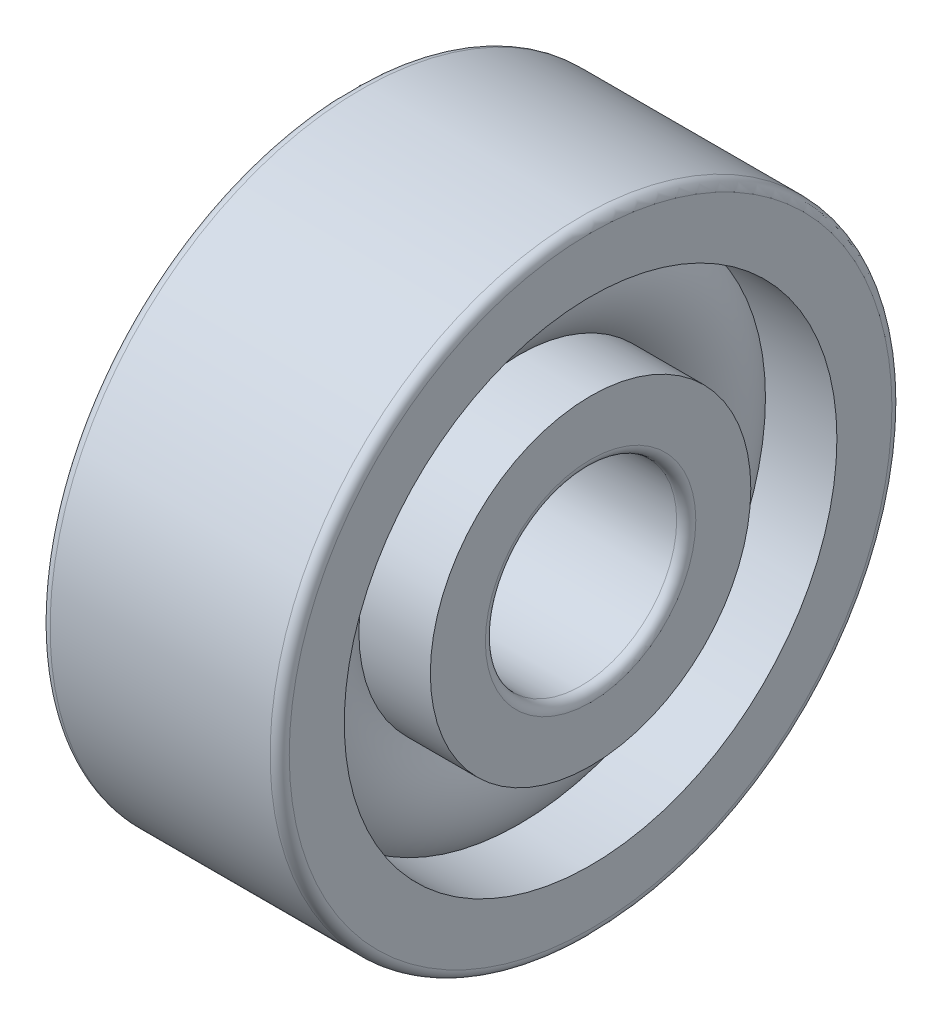
ISO-10303-21;
HEADER;
FILE_DESCRIPTION(('STEP AP214'),'2;1');
FILE_NAME('part.step','',(''),(''),'','','');
FILE_SCHEMA(('AUTOMOTIVE_DESIGN { 1 0 10303 214 1 1 1 1 }'));
ENDSEC;
DATA;
#1=APPLICATION_CONTEXT('core data for automotive mechanical design processes');
#2=APPLICATION_PROTOCOL_DEFINITION('international standard','automotive_design',2000,#1);
#3=PRODUCT_CONTEXT('',#1,'mechanical');
#4=PRODUCT('Part','Part','',(#3));
#5=PRODUCT_RELATED_PRODUCT_CATEGORY('part','',(#4));
#6=PRODUCT_DEFINITION_FORMATION('','',#4);
#7=PRODUCT_DEFINITION_CONTEXT('part definition',#1,'design');
#8=PRODUCT_DEFINITION('design','',#6,#7);
#9=PRODUCT_DEFINITION_SHAPE('','',#8);
#10=(LENGTH_UNIT() NAMED_UNIT(*) SI_UNIT(.MILLI.,.METRE.));
#11=(NAMED_UNIT(*) PLANE_ANGLE_UNIT() SI_UNIT($,.RADIAN.));
#12=(NAMED_UNIT(*) SI_UNIT($,.STERADIAN.) SOLID_ANGLE_UNIT());
#13=UNCERTAINTY_MEASURE_WITH_UNIT(LENGTH_MEASURE(1.E-05),#10,'distance_accuracy_value','');
#14=(GEOMETRIC_REPRESENTATION_CONTEXT(3) GLOBAL_UNCERTAINTY_ASSIGNED_CONTEXT((#13)) GLOBAL_UNIT_ASSIGNED_CONTEXT((#10,
#11,#12)) REPRESENTATION_CONTEXT('',''));
#15=CARTESIAN_POINT('',(0.,0.,0.));
#16=DIRECTION('',(0.,0.,1.));
#17=DIRECTION('',(1.,0.,0.));
#18=AXIS2_PLACEMENT_3D('',#15,#16,#17);
#19=CARTESIAN_POINT('',(0.,0.,0.));
#20=DIRECTION('',(-1.,0.,0.));
#21=DIRECTION('',(0.,0.,1.));
#22=AXIS2_PLACEMENT_3D('',#19,#20,#21);
#23=TOROIDAL_SURFACE('',#22,4.25,1.35);
#24=CARTESIAN_POINT('',(1.0062305898749,0.,0.));
#25=DIRECTION('',(-1.,0.,0.));
#26=DIRECTION('',(0.,0.,1.));
#27=AXIS2_PLACEMENT_3D('',#24,#25,#26);
#28=CIRCLE('',#27,5.15000000000001);
#29=CARTESIAN_POINT('',(1.0062305898749,0.,5.15000000000001));
#30=VERTEX_POINT('',#29);
#31=EDGE_CURVE('E34',#30,#30,#28,.F.);
#32=ORIENTED_EDGE('',*,*,#31,.T.);
#33=EDGE_LOOP('',(#32));
#34=FACE_BOUND('',#33,.T.);
#35=CARTESIAN_POINT('',(1.0062305898749,0.,0.));
#36=DIRECTION('',(-1.,0.,0.));
#37=DIRECTION('',(0.,0.,1.));
#38=AXIS2_PLACEMENT_3D('',#35,#36,#37);
#39=CIRCLE('',#38,3.35);
#40=CARTESIAN_POINT('',(1.0062305898749,0.,3.35));
#41=VERTEX_POINT('',#40);
#42=EDGE_CURVE('E10',#41,#41,#39,.T.);
#43=ORIENTED_EDGE('',*,*,#42,.T.);
#44=EDGE_LOOP('',(#43));
#45=FACE_BOUND('',#44,.T.);
#46=ADVANCED_FACE('F30',(#34,#45),#23,.T.);
#47=CARTESIAN_POINT('',(-20.6375,0.,0.));
#48=DIRECTION('',(1.,0.,0.));
#49=DIRECTION('',(0.,0.,-1.));
#50=AXIS2_PLACEMENT_3D('',#47,#48,#49);
#51=CYLINDRICAL_SURFACE('',#50,3.35);
#52=CARTESIAN_POINT('',(2.5,0.,0.));
#53=DIRECTION('',(1.,0.,0.));
#54=DIRECTION('',(0.,0.,-1.));
#55=AXIS2_PLACEMENT_3D('',#52,#53,#54);
#56=CIRCLE('',#55,3.35);
#57=CARTESIAN_POINT('',(2.5,0.,-3.35));
#58=VERTEX_POINT('',#57);
#59=EDGE_CURVE('E43',#58,#58,#56,.T.);
#60=ORIENTED_EDGE('',*,*,#59,.F.);
#61=EDGE_LOOP('',(#60));
#62=FACE_BOUND('',#61,.T.);
#63=ORIENTED_EDGE('',*,*,#42,.F.);
#64=EDGE_LOOP('',(#63));
#65=FACE_BOUND('',#64,.T.);
#66=ADVANCED_FACE('F82',(#62,#65),#51,.T.);
#67=CARTESIAN_POINT('',(-20.6375,0.,0.));
#68=DIRECTION('',(1.,0.,0.));
#69=DIRECTION('',(0.,0.,-1.));
#70=AXIS2_PLACEMENT_3D('',#67,#68,#69);
#71=CYLINDRICAL_SURFACE('',#70,3.35);
#72=CARTESIAN_POINT('',(-2.5,0.,0.));
#73=DIRECTION('',(1.,0.,0.));
#74=DIRECTION('',(0.,0.,-1.));
#75=AXIS2_PLACEMENT_3D('',#72,#73,#74);
#76=CIRCLE('',#75,3.35);
#77=CARTESIAN_POINT('',(-2.5,0.,-3.35));
#78=VERTEX_POINT('',#77);
#79=EDGE_CURVE('E52',#78,#78,#76,.T.);
#80=ORIENTED_EDGE('',*,*,#79,.T.);
#81=EDGE_LOOP('',(#80));
#82=FACE_BOUND('',#81,.T.);
#83=CARTESIAN_POINT('',(-1.0062305898749,0.,0.));
#84=DIRECTION('',(1.,0.,0.));
#85=DIRECTION('',(0.,0.,-1.));
#86=AXIS2_PLACEMENT_3D('',#83,#84,#85);
#87=CIRCLE('',#86,3.35);
#88=CARTESIAN_POINT('',(-1.0062305898749,0.,-3.35));
#89=VERTEX_POINT('',#88);
#90=EDGE_CURVE('E38',#89,#89,#87,.T.);
#91=ORIENTED_EDGE('',*,*,#90,.F.);
#92=EDGE_LOOP('',(#91));
#93=FACE_BOUND('',#92,.T.);
#94=ADVANCED_FACE('F85',(#82,#93),#71,.T.);
#95=CARTESIAN_POINT('',(2.5,2.2,0.));
#96=DIRECTION('',(1.,0.,0.));
#97=DIRECTION('',(0.,0.,-1.));
#98=AXIS2_PLACEMENT_3D('',#95,#96,#97);
#99=PLANE('',#98);
#100=ORIENTED_EDGE('',*,*,#59,.T.);
#101=EDGE_LOOP('',(#100));
#102=FACE_BOUND('',#101,.T.);
#103=CARTESIAN_POINT('',(2.5,0.,0.));
#104=DIRECTION('',(1.,0.,0.));
#105=DIRECTION('',(0.,0.,-1.));
#106=AXIS2_PLACEMENT_3D('',#103,#104,#105);
#107=CIRCLE('',#106,2.2);
#108=CARTESIAN_POINT('',(2.5,0.,-2.2));
#109=VERTEX_POINT('',#108);
#110=EDGE_CURVE('E74',#109,#109,#107,.T.);
#111=ORIENTED_EDGE('',*,*,#110,.F.);
#112=EDGE_LOOP('',(#111));
#113=FACE_BOUND('',#112,.T.);
#114=ADVANCED_FACE('F79',(#102,#113),#99,.T.);
#115=CARTESIAN_POINT('',(2.3,0.,0.));
#116=DIRECTION('',(1.,0.,0.));
#117=DIRECTION('',(0.,0.,-1.));
#118=AXIS2_PLACEMENT_3D('',#115,#116,#117);
#119=TOROIDAL_SURFACE('',#118,2.2,0.2);
#120=ORIENTED_EDGE('',*,*,#110,.T.);
#121=EDGE_LOOP('',(#120));
#122=FACE_BOUND('',#121,.T.);
#123=CARTESIAN_POINT('',(2.3,0.,0.));
#124=DIRECTION('',(1.,0.,0.));
#125=DIRECTION('',(0.,0.,-1.));
#126=AXIS2_PLACEMENT_3D('',#123,#124,#125);
#127=CIRCLE('',#126,2.);
#128=CARTESIAN_POINT('',(2.3,0.,-2.));
#129=VERTEX_POINT('',#128);
#130=EDGE_CURVE('E71',#129,#129,#127,.T.);
#131=ORIENTED_EDGE('',*,*,#130,.F.);
#132=EDGE_LOOP('',(#131));
#133=FACE_BOUND('',#132,.T.);
#134=ADVANCED_FACE('F96',(#122,#133),#119,.T.);
#135=CARTESIAN_POINT('',(-20.6375,0.,0.));
#136=DIRECTION('',(1.,0.,0.));
#137=DIRECTION('',(0.,0.,-1.));
#138=AXIS2_PLACEMENT_3D('',#135,#136,#137);
#139=CYLINDRICAL_SURFACE('',#138,2.);
#140=ORIENTED_EDGE('',*,*,#130,.T.);
#141=EDGE_LOOP('',(#140));
#142=FACE_BOUND('',#141,.T.);
#143=CARTESIAN_POINT('',(-2.3,0.,0.));
#144=DIRECTION('',(1.,0.,0.));
#145=DIRECTION('',(0.,0.,-1.));
#146=AXIS2_PLACEMENT_3D('',#143,#144,#145);
#147=CIRCLE('',#146,2.);
#148=CARTESIAN_POINT('',(-2.3,0.,-2.));
#149=VERTEX_POINT('',#148);
#150=EDGE_CURVE('E68',#149,#149,#147,.T.);
#151=ORIENTED_EDGE('',*,*,#150,.F.);
#152=EDGE_LOOP('',(#151));
#153=FACE_BOUND('',#152,.T.);
#154=ADVANCED_FACE('F99',(#142,#153),#139,.F.);
#155=CARTESIAN_POINT('',(-2.3,0.,0.));
#156=DIRECTION('',(1.,0.,0.));
#157=DIRECTION('',(0.,0.,-1.));
#158=AXIS2_PLACEMENT_3D('',#155,#156,#157);
#159=TOROIDAL_SURFACE('',#158,2.2,0.2);
#160=ORIENTED_EDGE('',*,*,#150,.T.);
#161=EDGE_LOOP('',(#160));
#162=FACE_BOUND('',#161,.T.);
#163=CARTESIAN_POINT('',(-2.5,0.,0.));
#164=DIRECTION('',(1.,0.,0.));
#165=DIRECTION('',(0.,0.,-1.));
#166=AXIS2_PLACEMENT_3D('',#163,#164,#165);
#167=CIRCLE('',#166,2.2);
#168=CARTESIAN_POINT('',(-2.5,0.,-2.2));
#169=VERTEX_POINT('',#168);
#170=EDGE_CURVE('E65',#169,#169,#167,.T.);
#171=ORIENTED_EDGE('',*,*,#170,.F.);
#172=EDGE_LOOP('',(#171));
#173=FACE_BOUND('',#172,.T.);
#174=ADVANCED_FACE('F103',(#162,#173),#159,.T.);
#175=CARTESIAN_POINT('',(-2.5,3.35,0.));
#176=DIRECTION('',(-1.,0.,0.));
#177=DIRECTION('',(0.,0.,1.));
#178=AXIS2_PLACEMENT_3D('',#175,#176,#177);
#179=PLANE('',#178);
#180=ORIENTED_EDGE('',*,*,#170,.T.);
#181=EDGE_LOOP('',(#180));
#182=FACE_BOUND('',#181,.T.);
#183=ORIENTED_EDGE('',*,*,#79,.F.);
#184=EDGE_LOOP('',(#183));
#185=FACE_BOUND('',#184,.T.);
#186=ADVANCED_FACE('F107',(#182,#185),#179,.T.);
#187=CARTESIAN_POINT('',(-1.0062305898749,0.,0.));
#188=DIRECTION('',(1.,0.,0.));
#189=DIRECTION('',(0.,0.,-1.));
#190=AXIS2_PLACEMENT_3D('',#187,#188,#189);
#191=CIRCLE('',#190,5.15000000000001);
#192=CARTESIAN_POINT('',(-1.0062305898749,0.,-5.15000000000001));
#193=VERTEX_POINT('',#192);
#194=EDGE_CURVE('E46',#193,#193,#191,.F.);
#195=ORIENTED_EDGE('',*,*,#194,.T.);
#196=EDGE_LOOP('',(#195));
#197=FACE_BOUND('',#196,.T.);
#198=ORIENTED_EDGE('',*,*,#90,.T.);
#199=EDGE_LOOP('',(#198));
#200=FACE_BOUND('',#199,.T.);
#201=ADVANCED_FACE('F32',(#197,#200),#23,.T.);
#202=CARTESIAN_POINT('',(-20.6375,0.,0.));
#203=DIRECTION('',(1.,0.,0.));
#204=DIRECTION('',(0.,0.,-1.));
#205=AXIS2_PLACEMENT_3D('',#202,#203,#204);
#206=CYLINDRICAL_SURFACE('',#205,5.15000000000001);
#207=CARTESIAN_POINT('',(2.5,0.,0.));
#208=DIRECTION('',(1.,0.,0.));
#209=DIRECTION('',(0.,0.,-1.));
#210=AXIS2_PLACEMENT_3D('',#207,#208,#209);
#211=CIRCLE('',#210,5.15000000000001);
#212=CARTESIAN_POINT('',(2.5,0.,-5.15000000000001));
#213=VERTEX_POINT('',#212);
#214=EDGE_CURVE('E48',#213,#213,#211,.T.);
#215=ORIENTED_EDGE('',*,*,#214,.T.);
#216=EDGE_LOOP('',(#215));
#217=FACE_BOUND('',#216,.T.);
#218=ORIENTED_EDGE('',*,*,#31,.F.);
#219=EDGE_LOOP('',(#218));
#220=FACE_BOUND('',#219,.T.);
#221=ADVANCED_FACE('F112',(#217,#220),#206,.F.);
#222=CARTESIAN_POINT('',(-20.6375,0.,0.));
#223=DIRECTION('',(1.,0.,0.));
#224=DIRECTION('',(0.,0.,-1.));
#225=AXIS2_PLACEMENT_3D('',#222,#223,#224);
#226=CYLINDRICAL_SURFACE('',#225,5.15000000000001);
#227=CARTESIAN_POINT('',(-2.5,0.,0.));
#228=DIRECTION('',(1.,0.,0.));
#229=DIRECTION('',(0.,0.,-1.));
#230=AXIS2_PLACEMENT_3D('',#227,#228,#229);
#231=CIRCLE('',#230,5.15000000000001);
#232=CARTESIAN_POINT('',(-2.5,0.,-5.15000000000001));
#233=VERTEX_POINT('',#232);
#234=EDGE_CURVE('E143',#233,#233,#231,.T.);
#235=ORIENTED_EDGE('',*,*,#234,.F.);
#236=EDGE_LOOP('',(#235));
#237=FACE_BOUND('',#236,.T.);
#238=ORIENTED_EDGE('',*,*,#194,.F.);
#239=EDGE_LOOP('',(#238));
#240=FACE_BOUND('',#239,.T.);
#241=ADVANCED_FACE('F115',(#237,#240),#226,.F.);
#242=CARTESIAN_POINT('',(2.5,6.30000000000001,0.));
#243=DIRECTION('',(1.,0.,0.));
#244=DIRECTION('',(0.,0.,-1.));
#245=AXIS2_PLACEMENT_3D('',#242,#243,#244);
#246=PLANE('',#245);
#247=CARTESIAN_POINT('',(2.5,0.,0.));
#248=DIRECTION('',(1.,0.,0.));
#249=DIRECTION('',(0.,0.,-1.));
#250=AXIS2_PLACEMENT_3D('',#247,#248,#249);
#251=CIRCLE('',#250,6.30000000000001);
#252=CARTESIAN_POINT('',(2.5,0.,-6.30000000000001));
#253=VERTEX_POINT('',#252);
#254=EDGE_CURVE('E54',#253,#253,#251,.T.);
#255=ORIENTED_EDGE('',*,*,#254,.T.);
#256=EDGE_LOOP('',(#255));
#257=FACE_BOUND('',#256,.T.);
#258=ORIENTED_EDGE('',*,*,#214,.F.);
#259=EDGE_LOOP('',(#258));
#260=FACE_BOUND('',#259,.T.);
#261=ADVANCED_FACE('F116',(#257,#260),#246,.T.);
#262=CARTESIAN_POINT('',(2.3,0.,0.));
#263=DIRECTION('',(1.,0.,0.));
#264=DIRECTION('',(0.,0.,-1.));
#265=AXIS2_PLACEMENT_3D('',#262,#263,#264);
#266=TOROIDAL_SURFACE('',#265,6.30000000000001,0.2);
#267=CARTESIAN_POINT('',(2.3,0.,0.));
#268=DIRECTION('',(1.,0.,0.));
#269=DIRECTION('',(0.,0.,-1.));
#270=AXIS2_PLACEMENT_3D('',#267,#268,#269);
#271=CIRCLE('',#270,6.50000000000001);
#272=CARTESIAN_POINT('',(2.3,0.,-6.50000000000001));
#273=VERTEX_POINT('',#272);
#274=EDGE_CURVE('E59',#273,#273,#271,.T.);
#275=ORIENTED_EDGE('',*,*,#274,.T.);
#276=EDGE_LOOP('',(#275));
#277=FACE_BOUND('',#276,.T.);
#278=ORIENTED_EDGE('',*,*,#254,.F.);
#279=EDGE_LOOP('',(#278));
#280=FACE_BOUND('',#279,.T.);
#281=ADVANCED_FACE('F119',(#277,#280),#266,.T.);
#282=CARTESIAN_POINT('',(-20.6375,0.,0.));
#283=DIRECTION('',(1.,0.,0.));
#284=DIRECTION('',(0.,0.,-1.));
#285=AXIS2_PLACEMENT_3D('',#282,#283,#284);
#286=CYLINDRICAL_SURFACE('',#285,6.50000000000001);
#287=CARTESIAN_POINT('',(-2.3,0.,0.));
#288=DIRECTION('',(1.,0.,0.));
#289=DIRECTION('',(0.,0.,-1.));
#290=AXIS2_PLACEMENT_3D('',#287,#288,#289);
#291=CIRCLE('',#290,6.50000000000001);
#292=CARTESIAN_POINT('',(-2.3,0.,-6.50000000000001));
#293=VERTEX_POINT('',#292);
#294=EDGE_CURVE('E147',#293,#293,#291,.T.);
#295=ORIENTED_EDGE('',*,*,#294,.T.);
#296=EDGE_LOOP('',(#295));
#297=FACE_BOUND('',#296,.T.);
#298=ORIENTED_EDGE('',*,*,#274,.F.);
#299=EDGE_LOOP('',(#298));
#300=FACE_BOUND('',#299,.T.);
#301=ADVANCED_FACE('F123',(#297,#300),#286,.T.);
#302=CARTESIAN_POINT('',(-2.3,0.,0.));
#303=DIRECTION('',(1.,0.,0.));
#304=DIRECTION('',(0.,0.,-1.));
#305=AXIS2_PLACEMENT_3D('',#302,#303,#304);
#306=TOROIDAL_SURFACE('',#305,6.30000000000001,0.2);
#307=CARTESIAN_POINT('',(-2.5,0.,0.));
#308=DIRECTION('',(1.,0.,0.));
#309=DIRECTION('',(0.,0.,-1.));
#310=AXIS2_PLACEMENT_3D('',#307,#308,#309);
#311=CIRCLE('',#310,6.30000000000001);
#312=CARTESIAN_POINT('',(-2.5,0.,-6.30000000000001));
#313=VERTEX_POINT('',#312);
#314=EDGE_CURVE('E144',#313,#313,#311,.T.);
#315=ORIENTED_EDGE('',*,*,#314,.T.);
#316=EDGE_LOOP('',(#315));
#317=FACE_BOUND('',#316,.T.);
#318=ORIENTED_EDGE('',*,*,#294,.F.);
#319=EDGE_LOOP('',(#318));
#320=FACE_BOUND('',#319,.T.);
#321=ADVANCED_FACE('F127',(#317,#320),#306,.T.);
#322=CARTESIAN_POINT('',(-2.5,5.15000000000001,0.));
#323=DIRECTION('',(-1.,0.,0.));
#324=DIRECTION('',(0.,0.,1.));
#325=AXIS2_PLACEMENT_3D('',#322,#323,#324);
#326=PLANE('',#325);
#327=ORIENTED_EDGE('',*,*,#234,.T.);
#328=EDGE_LOOP('',(#327));
#329=FACE_BOUND('',#328,.T.);
#330=ORIENTED_EDGE('',*,*,#314,.F.);
#331=EDGE_LOOP('',(#330));
#332=FACE_BOUND('',#331,.T.);
#333=ADVANCED_FACE('F131',(#329,#332),#326,.T.);
#334=CLOSED_SHELL('',(#46,#66,#94,#114,#134,#154,#174,#186,#201,#221,#241,#261,#281,#301,#321,#333));
#335=MANIFOLD_SOLID_BREP('B2',#334);
#336=ADVANCED_BREP_SHAPE_REPRESENTATION('',(#18,#335),#14);
#337=SHAPE_DEFINITION_REPRESENTATION(#9,#336);
ENDSEC;
END-ISO-10303-21;
